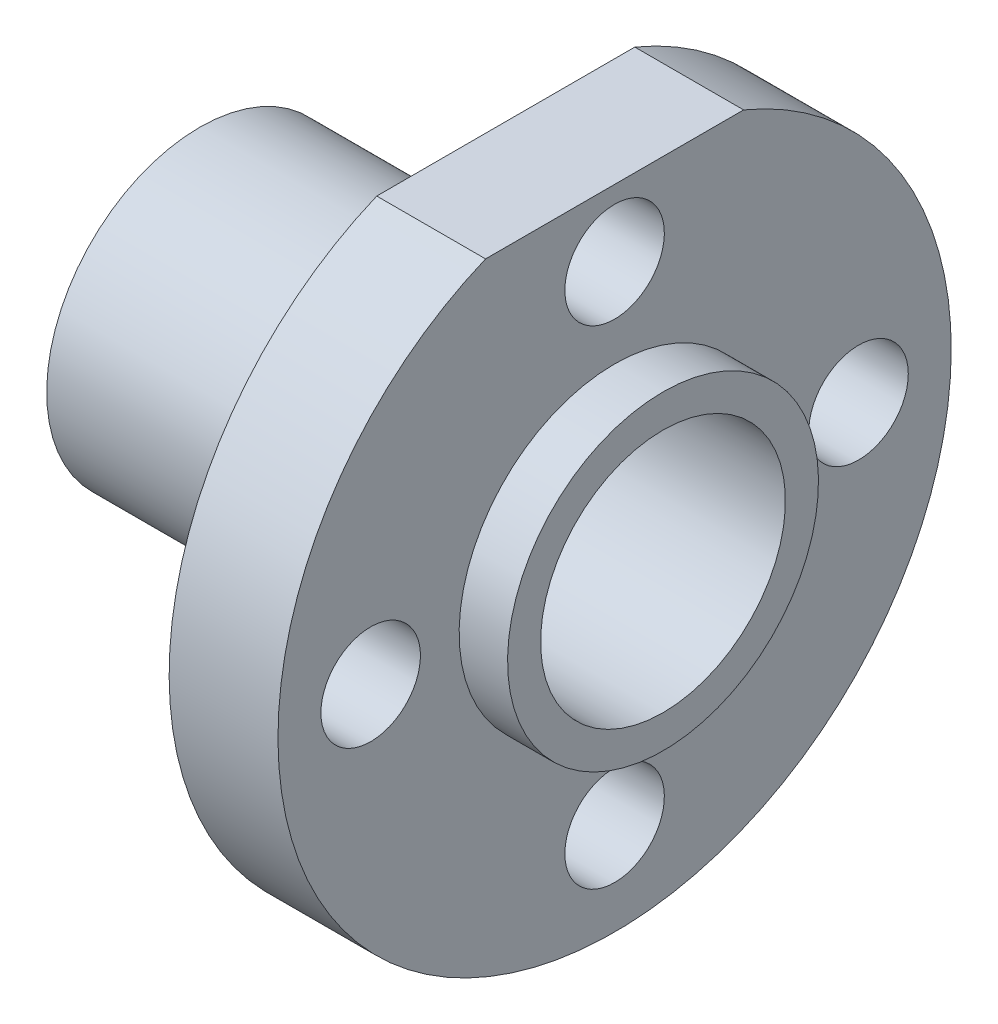
ISO-10303-21;
HEADER;
FILE_DESCRIPTION(('STEP AP214'),'2;1');
FILE_NAME('part.step','',(''),(''),'','','');
FILE_SCHEMA(('AUTOMOTIVE_DESIGN { 1 0 10303 214 1 1 1 1 }'));
ENDSEC;
DATA;
#1=APPLICATION_CONTEXT('core data for automotive mechanical design processes');
#2=APPLICATION_PROTOCOL_DEFINITION('international standard','automotive_design',2000,#1);
#3=PRODUCT_CONTEXT('',#1,'mechanical');
#4=PRODUCT('Part','Part','',(#3));
#5=PRODUCT_RELATED_PRODUCT_CATEGORY('part','',(#4));
#6=PRODUCT_DEFINITION_FORMATION('','',#4);
#7=PRODUCT_DEFINITION_CONTEXT('part definition',#1,'design');
#8=PRODUCT_DEFINITION('design','',#6,#7);
#9=PRODUCT_DEFINITION_SHAPE('','',#8);
#10=(LENGTH_UNIT() NAMED_UNIT(*) SI_UNIT(.MILLI.,.METRE.));
#11=(NAMED_UNIT(*) PLANE_ANGLE_UNIT() SI_UNIT($,.RADIAN.));
#12=(NAMED_UNIT(*) SI_UNIT($,.STERADIAN.) SOLID_ANGLE_UNIT());
#13=UNCERTAINTY_MEASURE_WITH_UNIT(LENGTH_MEASURE(1.E-05),#10,'distance_accuracy_value','');
#14=(GEOMETRIC_REPRESENTATION_CONTEXT(3) GLOBAL_UNCERTAINTY_ASSIGNED_CONTEXT((#13)) GLOBAL_UNIT_ASSIGNED_CONTEXT((#10,
#11,#12)) REPRESENTATION_CONTEXT('',''));
#15=CARTESIAN_POINT('',(0.,0.,0.));
#16=DIRECTION('',(0.,0.,1.));
#17=DIRECTION('',(1.,0.,0.));
#18=AXIS2_PLACEMENT_3D('',#15,#16,#17);
#19=CARTESIAN_POINT('',(0.,4.,0.));
#20=DIRECTION('',(1.,0.,0.));
#21=DIRECTION('',(0.,1.,0.));
#22=AXIS2_PLACEMENT_3D('',#19,#20,#21);
#23=PLANE('',#22);
#24=CARTESIAN_POINT('',(0.,0.,0.));
#25=DIRECTION('',(1.,0.,0.));
#26=DIRECTION('',(0.,1.,0.));
#27=AXIS2_PLACEMENT_3D('',#24,#25,#26);
#28=CIRCLE('',#27,5.08);
#29=CARTESIAN_POINT('',(0.,5.08,0.));
#30=VERTEX_POINT('',#29);
#31=EDGE_CURVE('E237',#30,#30,#28,.T.);
#32=ORIENTED_EDGE('',*,*,#31,.T.);
#33=EDGE_LOOP('',(#32));
#34=FACE_BOUND('',#33,.T.);
#35=CARTESIAN_POINT('',(0.,0.,0.));
#36=DIRECTION('',(1.,0.,0.));
#37=DIRECTION('',(0.,1.,0.));
#38=AXIS2_PLACEMENT_3D('',#35,#36,#37);
#39=CIRCLE('',#38,4.);
#40=CARTESIAN_POINT('',(0.,4.,0.));
#41=VERTEX_POINT('',#40);
#42=EDGE_CURVE('E11',#41,#41,#39,.T.);
#43=ORIENTED_EDGE('',*,*,#42,.F.);
#44=EDGE_LOOP('',(#43));
#45=FACE_BOUND('',#44,.T.);
#46=ADVANCED_FACE('F33',(#34,#45),#23,.T.);
#47=CARTESIAN_POINT('',(0.,0.,0.));
#48=DIRECTION('',(1.,0.,0.));
#49=DIRECTION('',(0.,1.,0.));
#50=AXIS2_PLACEMENT_3D('',#47,#48,#49);
#51=CYLINDRICAL_SURFACE('',#50,4.);
#52=ORIENTED_EDGE('',*,*,#42,.T.);
#53=EDGE_LOOP('',(#52));
#54=FACE_BOUND('',#53,.T.);
#55=CARTESIAN_POINT('',(-15.1384,0.,0.));
#56=DIRECTION('',(1.,0.,0.));
#57=DIRECTION('',(0.,1.,0.));
#58=AXIS2_PLACEMENT_3D('',#55,#56,#57);
#59=CIRCLE('',#58,4.);
#60=CARTESIAN_POINT('',(-15.1384,4.,0.));
#61=VERTEX_POINT('',#60);
#62=EDGE_CURVE('E40',#61,#61,#59,.T.);
#63=ORIENTED_EDGE('',*,*,#62,.F.);
#64=EDGE_LOOP('',(#63));
#65=FACE_BOUND('',#64,.T.);
#66=ADVANCED_FACE('F89',(#54,#65),#51,.F.);
#67=CARTESIAN_POINT('',(-15.1384,4.99999,0.));
#68=DIRECTION('',(-1.,0.,0.));
#69=DIRECTION('',(0.,-1.,0.));
#70=AXIS2_PLACEMENT_3D('',#67,#68,#69);
#71=PLANE('',#70);
#72=ORIENTED_EDGE('',*,*,#62,.T.);
#73=EDGE_LOOP('',(#72));
#74=FACE_BOUND('',#73,.T.);
#75=CARTESIAN_POINT('',(-15.1384,0.,0.));
#76=DIRECTION('',(1.,0.,0.));
#77=DIRECTION('',(0.,1.,0.));
#78=AXIS2_PLACEMENT_3D('',#75,#76,#77);
#79=CIRCLE('',#78,4.99999);
#80=CARTESIAN_POINT('',(-15.1384,4.99999,0.));
#81=VERTEX_POINT('',#80);
#82=EDGE_CURVE('E76',#81,#81,#79,.T.);
#83=ORIENTED_EDGE('',*,*,#82,.F.);
#84=EDGE_LOOP('',(#83));
#85=FACE_BOUND('',#84,.T.);
#86=ADVANCED_FACE('F86',(#74,#85),#71,.T.);
#87=CARTESIAN_POINT('',(0.,0.,0.));
#88=DIRECTION('',(1.,0.,0.));
#89=DIRECTION('',(0.,1.,0.));
#90=AXIS2_PLACEMENT_3D('',#87,#88,#89);
#91=CYLINDRICAL_SURFACE('',#90,4.99999);
#92=ORIENTED_EDGE('',*,*,#82,.T.);
#93=EDGE_LOOP('',(#92));
#94=FACE_BOUND('',#93,.T.);
#95=CARTESIAN_POINT('',(-5.1384,0.,0.));
#96=DIRECTION('',(1.,0.,0.));
#97=DIRECTION('',(0.,1.,0.));
#98=AXIS2_PLACEMENT_3D('',#95,#96,#97);
#99=CIRCLE('',#98,4.99999);
#100=CARTESIAN_POINT('',(-5.1384,4.99999,0.));
#101=VERTEX_POINT('',#100);
#102=EDGE_CURVE('E72',#101,#101,#99,.T.);
#103=ORIENTED_EDGE('',*,*,#102,.F.);
#104=EDGE_LOOP('',(#103));
#105=FACE_BOUND('',#104,.T.);
#106=ADVANCED_FACE('F96',(#94,#105),#91,.T.);
#107=CARTESIAN_POINT('',(-5.1384,4.99999,0.));
#108=DIRECTION('',(-1.,0.,0.));
#109=DIRECTION('',(0.,-1.,0.));
#110=AXIS2_PLACEMENT_3D('',#107,#108,#109);
#111=PLANE('',#110);
#112=DIRECTION('',(0.,0.,-1.));
#113=VECTOR('',#112,1.);
#114=CARTESIAN_POINT('',(-5.1384,10.16,4.21596963935937));
#115=LINE('',#114,#113);
#116=CARTESIAN_POINT('',(-5.1384,10.16,4.21596963935937));
#117=VERTEX_POINT('',#116);
#118=CARTESIAN_POINT('',(-5.13840000000001,10.16,-4.21596963935937));
#119=VERTEX_POINT('',#118);
#120=EDGE_CURVE('E59',#117,#119,#115,.T.);
#121=ORIENTED_EDGE('',*,*,#120,.T.);
#122=CARTESIAN_POINT('',(-5.1384,0.,0.));
#123=DIRECTION('',(1.,0.,0.));
#124=DIRECTION('',(0.,1.,0.));
#125=AXIS2_PLACEMENT_3D('',#122,#123,#124);
#126=CIRCLE('',#125,11.);
#127=EDGE_CURVE('E69',#117,#119,#126,.T.);
#128=ORIENTED_EDGE('',*,*,#127,.F.);
#129=EDGE_LOOP('',(#121,#128));
#130=FACE_BOUND('',#129,.T.);
#131=CARTESIAN_POINT('',(-5.1384,0.,-7.97105));
#132=DIRECTION('',(-1.,0.,0.));
#133=DIRECTION('',(0.,-1.,0.));
#134=AXIS2_PLACEMENT_3D('',#131,#132,#133);
#135=CIRCLE('',#134,1.6256);
#136=CARTESIAN_POINT('',(-5.1384,-1.62560000000003,-7.97105));
#137=VERTEX_POINT('',#136);
#138=EDGE_CURVE('E214',#137,#137,#135,.F.);
#139=ORIENTED_EDGE('',*,*,#138,.T.);
#140=EDGE_LOOP('',(#139));
#141=FACE_BOUND('',#140,.T.);
#142=CARTESIAN_POINT('',(-5.1384,-7.97105,0.));
#143=DIRECTION('',(-1.,0.,0.));
#144=DIRECTION('',(0.,-1.,0.));
#145=AXIS2_PLACEMENT_3D('',#142,#143,#144);
#146=CIRCLE('',#145,1.6256);
#147=CARTESIAN_POINT('',(-5.1384,-9.59665,0.));
#148=VERTEX_POINT('',#147);
#149=EDGE_CURVE('E220',#148,#148,#146,.F.);
#150=ORIENTED_EDGE('',*,*,#149,.T.);
#151=EDGE_LOOP('',(#150));
#152=FACE_BOUND('',#151,.T.);
#153=CARTESIAN_POINT('',(-5.1384,0.,7.97105));
#154=DIRECTION('',(-1.,0.,0.));
#155=DIRECTION('',(0.,-1.,0.));
#156=AXIS2_PLACEMENT_3D('',#153,#154,#155);
#157=CIRCLE('',#156,1.6256);
#158=CARTESIAN_POINT('',(-5.1384,-1.62559999999992,7.97105));
#159=VERTEX_POINT('',#158);
#160=EDGE_CURVE('E227',#159,#159,#157,.F.);
#161=ORIENTED_EDGE('',*,*,#160,.T.);
#162=EDGE_LOOP('',(#161));
#163=FACE_BOUND('',#162,.T.);
#164=CARTESIAN_POINT('',(-5.1384,7.97105,0.));
#165=DIRECTION('',(-1.,0.,0.));
#166=DIRECTION('',(0.,-1.,0.));
#167=AXIS2_PLACEMENT_3D('',#164,#165,#166);
#168=CIRCLE('',#167,1.6256);
#169=CARTESIAN_POINT('',(-5.1384,6.34545,0.));
#170=VERTEX_POINT('',#169);
#171=EDGE_CURVE('E218',#170,#170,#168,.F.);
#172=ORIENTED_EDGE('',*,*,#171,.T.);
#173=EDGE_LOOP('',(#172));
#174=FACE_BOUND('',#173,.T.);
#175=ORIENTED_EDGE('',*,*,#102,.T.);
#176=EDGE_LOOP('',(#175));
#177=FACE_BOUND('',#176,.T.);
#178=ADVANCED_FACE('F67',(#130,#141,#152,#163,#174,#177),#111,.T.);
#179=CARTESIAN_POINT('',(0.,0.,0.));
#180=DIRECTION('',(1.,0.,0.));
#181=DIRECTION('',(0.,1.,0.));
#182=AXIS2_PLACEMENT_3D('',#179,#180,#181);
#183=CYLINDRICAL_SURFACE('',#182,11.);
#184=DIRECTION('',(1.,0.,0.));
#185=VECTOR('',#184,1.);
#186=CARTESIAN_POINT('',(-13.6120768878687,10.16,-4.21596963935937));
#187=LINE('',#186,#185);
#188=CARTESIAN_POINT('',(-1.5824,10.16,-4.21596963935937));
#189=VERTEX_POINT('',#188);
#190=EDGE_CURVE('E56',#119,#189,#187,.T.);
#191=ORIENTED_EDGE('',*,*,#190,.T.);
#192=CARTESIAN_POINT('',(-1.5824,0.,0.));
#193=DIRECTION('',(1.,0.,0.));
#194=DIRECTION('',(0.,1.,0.));
#195=AXIS2_PLACEMENT_3D('',#192,#193,#194);
#196=CIRCLE('',#195,11.);
#197=CARTESIAN_POINT('',(-1.5824,10.16,4.21596963935937));
#198=VERTEX_POINT('',#197);
#199=EDGE_CURVE('E73',#198,#189,#196,.T.);
#200=ORIENTED_EDGE('',*,*,#199,.F.);
#201=DIRECTION('',(1.,0.,0.));
#202=VECTOR('',#201,1.);
#203=CARTESIAN_POINT('',(-13.6120768878687,10.16,4.21596963935937));
#204=LINE('',#203,#202);
#205=EDGE_CURVE('E47',#117,#198,#204,.T.);
#206=ORIENTED_EDGE('',*,*,#205,.F.);
#207=ORIENTED_EDGE('',*,*,#127,.T.);
#208=EDGE_LOOP('',(#191,#200,#206,#207));
#209=FACE_BOUND('',#208,.T.);
#210=ADVANCED_FACE('F71',(#209),#183,.T.);
#211=CARTESIAN_POINT('',(-1.5824,11.,0.));
#212=DIRECTION('',(1.,0.,0.));
#213=DIRECTION('',(0.,1.,0.));
#214=AXIS2_PLACEMENT_3D('',#211,#212,#213);
#215=PLANE('',#214);
#216=DIRECTION('',(0.,0.,-1.));
#217=VECTOR('',#216,1.);
#218=CARTESIAN_POINT('',(-1.5824,10.16,4.21596963935937));
#219=LINE('',#218,#217);
#220=EDGE_CURVE('E52',#198,#189,#219,.T.);
#221=ORIENTED_EDGE('',*,*,#220,.F.);
#222=ORIENTED_EDGE('',*,*,#199,.T.);
#223=EDGE_LOOP('',(#221,#222));
#224=FACE_BOUND('',#223,.T.);
#225=CARTESIAN_POINT('',(-1.5824,0.,-7.97105));
#226=DIRECTION('',(1.,0.,0.));
#227=DIRECTION('',(0.,0.,-1.));
#228=AXIS2_PLACEMENT_3D('',#225,#226,#227);
#229=CIRCLE('',#228,1.6256);
#230=CARTESIAN_POINT('',(-1.5824,0.,-9.59665));
#231=VERTEX_POINT('',#230);
#232=EDGE_CURVE('E211',#231,#231,#229,.T.);
#233=ORIENTED_EDGE('',*,*,#232,.F.);
#234=EDGE_LOOP('',(#233));
#235=FACE_BOUND('',#234,.T.);
#236=CARTESIAN_POINT('',(-1.5824,-7.97105,0.));
#237=DIRECTION('',(1.,0.,0.));
#238=DIRECTION('',(0.,-1.,0.));
#239=AXIS2_PLACEMENT_3D('',#236,#237,#238);
#240=CIRCLE('',#239,1.6256);
#241=CARTESIAN_POINT('',(-1.5824,-9.59665,0.));
#242=VERTEX_POINT('',#241);
#243=EDGE_CURVE('E224',#242,#242,#240,.T.);
#244=ORIENTED_EDGE('',*,*,#243,.F.);
#245=EDGE_LOOP('',(#244));
#246=FACE_BOUND('',#245,.T.);
#247=CARTESIAN_POINT('',(-1.5824,0.,7.97105));
#248=DIRECTION('',(1.,0.,0.));
#249=DIRECTION('',(0.,0.,1.));
#250=AXIS2_PLACEMENT_3D('',#247,#248,#249);
#251=CIRCLE('',#250,1.6256);
#252=CARTESIAN_POINT('',(-1.5824,1.00338244468829E-13,9.59665));
#253=VERTEX_POINT('',#252);
#254=EDGE_CURVE('E230',#253,#253,#251,.T.);
#255=ORIENTED_EDGE('',*,*,#254,.F.);
#256=EDGE_LOOP('',(#255));
#257=FACE_BOUND('',#256,.T.);
#258=CARTESIAN_POINT('',(-1.5824,7.97105,0.));
#259=DIRECTION('',(1.,0.,0.));
#260=DIRECTION('',(0.,1.,0.));
#261=AXIS2_PLACEMENT_3D('',#258,#259,#260);
#262=CIRCLE('',#261,1.6256);
#263=CARTESIAN_POINT('',(-1.5824,9.59665,0.));
#264=VERTEX_POINT('',#263);
#265=EDGE_CURVE('E215',#264,#264,#262,.T.);
#266=ORIENTED_EDGE('',*,*,#265,.F.);
#267=EDGE_LOOP('',(#266));
#268=FACE_BOUND('',#267,.T.);
#269=CARTESIAN_POINT('',(-1.5824,0.,0.));
#270=DIRECTION('',(1.,0.,0.));
#271=DIRECTION('',(0.,1.,0.));
#272=AXIS2_PLACEMENT_3D('',#269,#270,#271);
#273=CIRCLE('',#272,5.08);
#274=CARTESIAN_POINT('',(-1.5824,5.08,0.));
#275=VERTEX_POINT('',#274);
#276=EDGE_CURVE('E78',#275,#275,#273,.T.);
#277=ORIENTED_EDGE('',*,*,#276,.F.);
#278=EDGE_LOOP('',(#277));
#279=FACE_BOUND('',#278,.T.);
#280=ADVANCED_FACE('F107',(#224,#235,#246,#257,#268,#279),#215,.T.);
#281=CARTESIAN_POINT('',(0.,0.,0.));
#282=DIRECTION('',(1.,0.,0.));
#283=DIRECTION('',(0.,1.,0.));
#284=AXIS2_PLACEMENT_3D('',#281,#282,#283);
#285=CYLINDRICAL_SURFACE('',#284,5.08);
#286=ORIENTED_EDGE('',*,*,#276,.T.);
#287=EDGE_LOOP('',(#286));
#288=FACE_BOUND('',#287,.T.);
#289=ORIENTED_EDGE('',*,*,#31,.F.);
#290=EDGE_LOOP('',(#289));
#291=FACE_BOUND('',#290,.T.);
#292=ADVANCED_FACE('F110',(#288,#291),#285,.T.);
#293=CARTESIAN_POINT('',(-9.73629113398741,7.97105,0.));
#294=DIRECTION('',(1.,0.,0.));
#295=DIRECTION('',(0.,1.,0.));
#296=AXIS2_PLACEMENT_3D('',#293,#294,#295);
#297=CYLINDRICAL_SURFACE('',#296,1.6256);
#298=ORIENTED_EDGE('',*,*,#265,.T.);
#299=EDGE_LOOP('',(#298));
#300=FACE_BOUND('',#299,.T.);
#301=ORIENTED_EDGE('',*,*,#171,.F.);
#302=EDGE_LOOP('',(#301));
#303=FACE_BOUND('',#302,.T.);
#304=ADVANCED_FACE('F114',(#300,#303),#297,.F.);
#305=CARTESIAN_POINT('',(-9.73629113398741,0.,7.97105));
#306=DIRECTION('',(1.,0.,0.));
#307=DIRECTION('',(0.,1.,0.));
#308=AXIS2_PLACEMENT_3D('',#305,#306,#307);
#309=CYLINDRICAL_SURFACE('',#308,1.6256);
#310=ORIENTED_EDGE('',*,*,#254,.T.);
#311=EDGE_LOOP('',(#310));
#312=FACE_BOUND('',#311,.T.);
#313=ORIENTED_EDGE('',*,*,#160,.F.);
#314=EDGE_LOOP('',(#313));
#315=FACE_BOUND('',#314,.T.);
#316=ADVANCED_FACE('F118',(#312,#315),#309,.F.);
#317=CARTESIAN_POINT('',(-9.73629113398741,-7.97105,0.));
#318=DIRECTION('',(1.,0.,0.));
#319=DIRECTION('',(0.,1.,0.));
#320=AXIS2_PLACEMENT_3D('',#317,#318,#319);
#321=CYLINDRICAL_SURFACE('',#320,1.6256);
#322=ORIENTED_EDGE('',*,*,#243,.T.);
#323=EDGE_LOOP('',(#322));
#324=FACE_BOUND('',#323,.T.);
#325=ORIENTED_EDGE('',*,*,#149,.F.);
#326=EDGE_LOOP('',(#325));
#327=FACE_BOUND('',#326,.T.);
#328=ADVANCED_FACE('F122',(#324,#327),#321,.F.);
#329=CARTESIAN_POINT('',(-9.73629113398741,0.,-7.97105));
#330=DIRECTION('',(1.,0.,0.));
#331=DIRECTION('',(0.,1.,0.));
#332=AXIS2_PLACEMENT_3D('',#329,#330,#331);
#333=CYLINDRICAL_SURFACE('',#332,1.6256);
#334=ORIENTED_EDGE('',*,*,#232,.T.);
#335=EDGE_LOOP('',(#334));
#336=FACE_BOUND('',#335,.T.);
#337=ORIENTED_EDGE('',*,*,#138,.F.);
#338=EDGE_LOOP('',(#337));
#339=FACE_BOUND('',#338,.T.);
#340=ADVANCED_FACE('F126',(#336,#339),#333,.F.);
#341=CARTESIAN_POINT('',(-13.6120768878687,10.16,4.21596963935937));
#342=DIRECTION('',(0.,-1.,0.));
#343=DIRECTION('',(1.,0.,0.));
#344=AXIS2_PLACEMENT_3D('',#341,#342,#343);
#345=PLANE('',#344);
#346=ORIENTED_EDGE('',*,*,#205,.T.);
#347=ORIENTED_EDGE('',*,*,#220,.T.);
#348=ORIENTED_EDGE('',*,*,#190,.F.);
#349=ORIENTED_EDGE('',*,*,#120,.F.);
#350=EDGE_LOOP('',(#346,#347,#348,#349));
#351=FACE_BOUND('',#350,.T.);
#352=ADVANCED_FACE('F58',(#351),#345,.F.);
#353=CLOSED_SHELL('',(#46,#66,#86,#106,#178,#210,#280,#292,#304,#316,#328,#340,#352));
#354=MANIFOLD_SOLID_BREP('B2',#353);
#355=ADVANCED_BREP_SHAPE_REPRESENTATION('',(#18,#354),#14);
#356=SHAPE_DEFINITION_REPRESENTATION(#9,#355);
ENDSEC;
END-ISO-10303-21;
